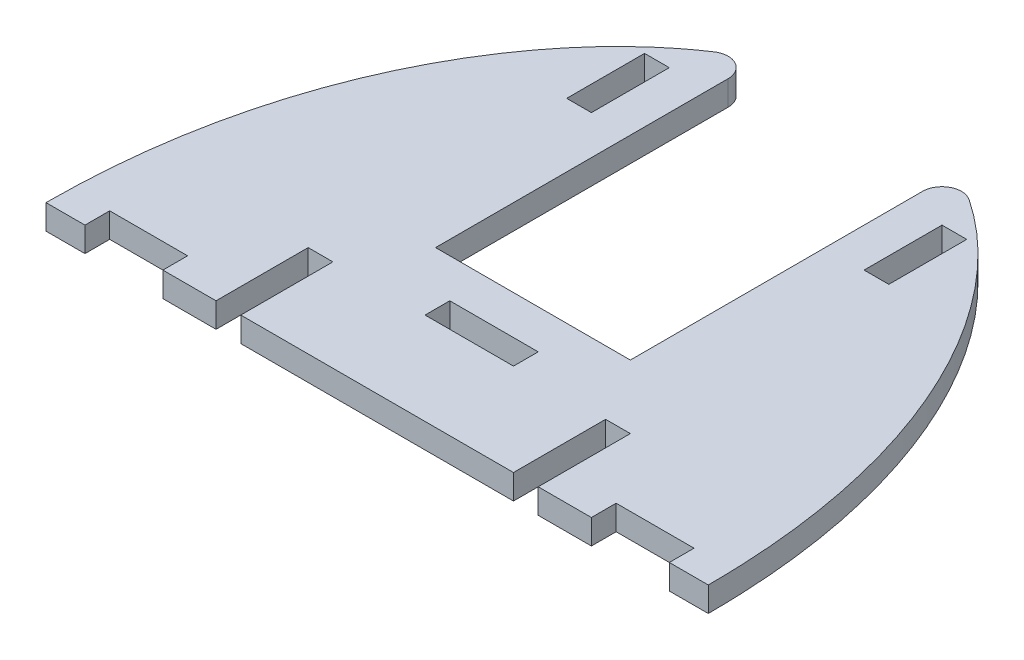
ISO-10303-21;
HEADER;
FILE_DESCRIPTION(('STEP AP214'),'2;1');
FILE_NAME('part.step','',(''),(''),'','','');
FILE_SCHEMA(('AUTOMOTIVE_DESIGN { 1 0 10303 214 1 1 1 1 }'));
ENDSEC;
DATA;
#1=APPLICATION_CONTEXT('core data for automotive mechanical design processes');
#2=APPLICATION_PROTOCOL_DEFINITION('international standard','automotive_design',2000,#1);
#3=PRODUCT_CONTEXT('',#1,'mechanical');
#4=PRODUCT('Part','Part','',(#3));
#5=PRODUCT_RELATED_PRODUCT_CATEGORY('part','',(#4));
#6=PRODUCT_DEFINITION_FORMATION('','',#4);
#7=PRODUCT_DEFINITION_CONTEXT('part definition',#1,'design');
#8=PRODUCT_DEFINITION('design','',#6,#7);
#9=PRODUCT_DEFINITION_SHAPE('','',#8);
#10=(LENGTH_UNIT() NAMED_UNIT(*) SI_UNIT(.MILLI.,.METRE.));
#11=(NAMED_UNIT(*) PLANE_ANGLE_UNIT() SI_UNIT($,.RADIAN.));
#12=(NAMED_UNIT(*) SI_UNIT($,.STERADIAN.) SOLID_ANGLE_UNIT());
#13=UNCERTAINTY_MEASURE_WITH_UNIT(LENGTH_MEASURE(1.E-05),#10,'distance_accuracy_value','');
#14=(GEOMETRIC_REPRESENTATION_CONTEXT(3) GLOBAL_UNCERTAINTY_ASSIGNED_CONTEXT((#13)) GLOBAL_UNIT_ASSIGNED_CONTEXT((#10,
#11,#12)) REPRESENTATION_CONTEXT('',''));
#15=CARTESIAN_POINT('',(0.,0.,0.));
#16=DIRECTION('',(0.,0.,1.));
#17=DIRECTION('',(1.,0.,0.));
#18=AXIS2_PLACEMENT_3D('',#15,#16,#17);
#19=CARTESIAN_POINT('',(0.,3.175,0.));
#20=DIRECTION('',(0.,0.,-1.));
#21=DIRECTION('',(-1.,0.,0.));
#22=AXIS2_PLACEMENT_3D('',#19,#20,#21);
#23=PLANE('',#22);
#24=DIRECTION('',(1.,0.,0.));
#25=VECTOR('',#24,1.);
#26=CARTESIAN_POINT('',(0.,0.,0.));
#27=LINE('',#26,#25);
#28=CARTESIAN_POINT('',(0.,0.,0.));
#29=VERTEX_POINT('',#28);
#30=CARTESIAN_POINT('',(5.,0.,0.));
#31=VERTEX_POINT('',#30);
#32=EDGE_CURVE('E603',#29,#31,#27,.T.);
#33=ORIENTED_EDGE('',*,*,#32,.T.);
#34=DIRECTION('',(0.,1.,0.));
#35=VECTOR('',#34,1.);
#36=CARTESIAN_POINT('',(5.,0.,0.));
#37=LINE('',#36,#35);
#38=CARTESIAN_POINT('',(5.,3.175,0.));
#39=VERTEX_POINT('',#38);
#40=EDGE_CURVE('E355',#31,#39,#37,.T.);
#41=ORIENTED_EDGE('',*,*,#40,.T.);
#42=DIRECTION('',(1.,0.,0.));
#43=VECTOR('',#42,1.);
#44=CARTESIAN_POINT('',(0.,3.175,0.));
#45=LINE('',#44,#43);
#46=CARTESIAN_POINT('',(0.,3.175,0.));
#47=VERTEX_POINT('',#46);
#48=EDGE_CURVE('E507',#47,#39,#45,.T.);
#49=ORIENTED_EDGE('',*,*,#48,.F.);
#50=DIRECTION('',(0.,-1.,0.));
#51=VECTOR('',#50,1.);
#52=CARTESIAN_POINT('',(0.,3.175,0.));
#53=LINE('',#52,#51);
#54=EDGE_CURVE('E598',#47,#29,#53,.T.);
#55=ORIENTED_EDGE('',*,*,#54,.T.);
#56=EDGE_LOOP('',(#33,#41,#49,#55));
#57=FACE_BOUND('',#56,.T.);
#58=ADVANCED_FACE('F35',(#57),#23,.F.);
#59=CARTESIAN_POINT('',(0.,3.175,0.));
#60=CARTESIAN_POINT('',(-4.55885329486704E-13,3.175,-36.));
#61=CARTESIAN_POINT('',(22.3987373470688,3.175,-65.1748553419662));
#62=CARTESIAN_POINT('',(62.2975079140465,3.175,-65.3077234127981));
#63=CARTESIAN_POINT('',(85.,3.175,-36.));
#64=CARTESIAN_POINT('',(85.,3.175,0.));
#65=B_SPLINE_CURVE_WITH_KNOTS('',3,(#59,#60,#61,#62,#63,#64),.UNSPECIFIED.,.F.,.F.,(4,1,1,4),
(0.,0.452811162525175,0.552811162525175,1.),.UNSPECIFIED.);
#66=DIRECTION('',(0.,-1.,0.));
#67=VECTOR('',#66,1.);
#68=SURFACE_OF_LINEAR_EXTRUSION('',#65,#67);
#69=CARTESIAN_POINT('',(26.1192033013856,3.175,-59.6339964677522));
#70=VERTEX_POINT('',#69);
#71=EDGE_CURVE('E500',#47,#70,#65,.T.);
#72=ORIENTED_EDGE('',*,*,#71,.T.);
#73=DIRECTION('',(0.,-1.,0.));
#74=VECTOR('',#73,1.);
#75=CARTESIAN_POINT('',(26.1192033013878,3.175,-59.6339964677536));
#76=LINE('',#75,#74);
#77=CARTESIAN_POINT('',(26.1192033013856,0.,-59.6339964677522));
#78=VERTEX_POINT('',#77);
#79=EDGE_CURVE('E11',#70,#78,#76,.T.);
#80=ORIENTED_EDGE('',*,*,#79,.T.);
#81=CARTESIAN_POINT('',(0.,0.,0.));
#82=CARTESIAN_POINT('',(-4.55885329486704E-13,0.,-36.));
#83=CARTESIAN_POINT('',(22.3987373470688,0.,-65.1748553419662));
#84=CARTESIAN_POINT('',(62.2975079140465,0.,-65.3077234127981));
#85=CARTESIAN_POINT('',(85.,0.,-36.));
#86=CARTESIAN_POINT('',(85.,0.,0.));
#87=B_SPLINE_CURVE_WITH_KNOTS('',3,(#81,#82,#83,#84,#85,#86),.UNSPECIFIED.,.F.,.F.,(4,1,1,4),
(0.,0.452811162525175,0.552811162525175,1.),.UNSPECIFIED.);
#88=EDGE_CURVE('E631',#29,#78,#87,.T.);
#89=ORIENTED_EDGE('',*,*,#88,.F.);
#90=ORIENTED_EDGE('',*,*,#54,.F.);
#91=EDGE_LOOP('',(#72,#80,#89,#90));
#92=FACE_BOUND('',#91,.T.);
#93=ADVANCED_FACE('F519',(#92),#68,.T.);
#94=CARTESIAN_POINT('',(63.1750000000003,0.,0.));
#95=VERTEX_POINT('',#94);
#96=CARTESIAN_POINT('',(70.,0.,0.));
#97=VERTEX_POINT('',#96);
#98=EDGE_CURVE('E585',#95,#97,#27,.T.);
#99=ORIENTED_EDGE('',*,*,#98,.T.);
#100=DIRECTION('',(0.,1.,0.));
#101=VECTOR('',#100,1.);
#102=CARTESIAN_POINT('',(70.,0.,0.));
#103=LINE('',#102,#101);
#104=CARTESIAN_POINT('',(70.,3.175,0.));
#105=VERTEX_POINT('',#104);
#106=EDGE_CURVE('E381',#97,#105,#103,.T.);
#107=ORIENTED_EDGE('',*,*,#106,.T.);
#108=CARTESIAN_POINT('',(63.1750000000003,3.175,0.));
#109=VERTEX_POINT('',#108);
#110=EDGE_CURVE('E569',#109,#105,#45,.T.);
#111=ORIENTED_EDGE('',*,*,#110,.F.);
#112=DIRECTION('',(0.,1.,0.));
#113=VECTOR('',#112,1.);
#114=CARTESIAN_POINT('',(63.1750000000003,0.,0.));
#115=LINE('',#114,#113);
#116=EDGE_CURVE('E415',#95,#109,#115,.T.);
#117=ORIENTED_EDGE('',*,*,#116,.F.);
#118=EDGE_LOOP('',(#99,#107,#111,#117));
#119=FACE_BOUND('',#118,.T.);
#120=ADVANCED_FACE('F535',(#119),#23,.F.);
#121=CARTESIAN_POINT('',(80.,3.175,0.));
#122=VERTEX_POINT('',#121);
#123=CARTESIAN_POINT('',(85.,3.175,0.));
#124=VERTEX_POINT('',#123);
#125=EDGE_CURVE('E505',#122,#124,#45,.T.);
#126=ORIENTED_EDGE('',*,*,#125,.F.);
#127=DIRECTION('',(0.,1.,0.));
#128=VECTOR('',#127,1.);
#129=CARTESIAN_POINT('',(80.,0.,0.));
#130=LINE('',#129,#128);
#131=CARTESIAN_POINT('',(80.,0.,0.));
#132=VERTEX_POINT('',#131);
#133=EDGE_CURVE('E392',#132,#122,#130,.T.);
#134=ORIENTED_EDGE('',*,*,#133,.F.);
#135=CARTESIAN_POINT('',(85.,0.,0.));
#136=VERTEX_POINT('',#135);
#137=EDGE_CURVE('E596',#132,#136,#27,.T.);
#138=ORIENTED_EDGE('',*,*,#137,.T.);
#139=DIRECTION('',(0.,-1.,0.));
#140=VECTOR('',#139,1.);
#141=CARTESIAN_POINT('',(85.,3.175,0.));
#142=LINE('',#141,#140);
#143=EDGE_CURVE('E567',#124,#136,#142,.T.);
#144=ORIENTED_EDGE('',*,*,#143,.F.);
#145=EDGE_LOOP('',(#126,#134,#138,#144));
#146=FACE_BOUND('',#145,.T.);
#147=ADVANCED_FACE('F542',(#146),#23,.F.);
#148=CARTESIAN_POINT('',(15.,3.175,0.));
#149=VERTEX_POINT('',#148);
#150=CARTESIAN_POINT('',(21.8250000000003,3.175,0.));
#151=VERTEX_POINT('',#150);
#152=EDGE_CURVE('E560',#149,#151,#45,.T.);
#153=ORIENTED_EDGE('',*,*,#152,.F.);
#154=DIRECTION('',(0.,1.,0.));
#155=VECTOR('',#154,1.);
#156=CARTESIAN_POINT('',(15.,0.,0.));
#157=LINE('',#156,#155);
#158=CARTESIAN_POINT('',(15.,0.,0.));
#159=VERTEX_POINT('',#158);
#160=EDGE_CURVE('E367',#159,#149,#157,.T.);
#161=ORIENTED_EDGE('',*,*,#160,.F.);
#162=CARTESIAN_POINT('',(21.8250000000003,0.,0.));
#163=VERTEX_POINT('',#162);
#164=EDGE_CURVE('E988',#159,#163,#27,.T.);
#165=ORIENTED_EDGE('',*,*,#164,.T.);
#166=DIRECTION('',(0.,1.,0.));
#167=VECTOR('',#166,1.);
#168=CARTESIAN_POINT('',(21.8250000000003,0.,0.));
#169=LINE('',#168,#167);
#170=EDGE_CURVE('E491',#163,#151,#169,.T.);
#171=ORIENTED_EDGE('',*,*,#170,.T.);
#172=EDGE_LOOP('',(#153,#161,#165,#171));
#173=FACE_BOUND('',#172,.T.);
#174=ADVANCED_FACE('F517',(#173),#23,.F.);
#175=CARTESIAN_POINT('',(58.8890568242253,0.,-59.5813314436903));
#176=VERTEX_POINT('',#175);
#177=EDGE_CURVE('E494',#176,#136,#87,.T.);
#178=ORIENTED_EDGE('',*,*,#177,.F.);
#179=DIRECTION('',(0.,-1.,0.));
#180=VECTOR('',#179,1.);
#181=CARTESIAN_POINT('',(58.8890568242253,0.,-59.5813314436903));
#182=LINE('',#181,#180);
#183=CARTESIAN_POINT('',(58.8890568242253,3.175,-59.5813314436903));
#184=VERTEX_POINT('',#183);
#185=EDGE_CURVE('E613',#176,#184,#182,.F.);
#186=ORIENTED_EDGE('',*,*,#185,.T.);
#187=EDGE_CURVE('E506',#184,#124,#65,.T.);
#188=ORIENTED_EDGE('',*,*,#187,.T.);
#189=ORIENTED_EDGE('',*,*,#143,.T.);
#190=EDGE_LOOP('',(#178,#186,#188,#189));
#191=FACE_BOUND('',#190,.T.);
#192=ADVANCED_FACE('F513',(#191),#68,.T.);
#193=CARTESIAN_POINT('',(25.0000000000003,0.,0.));
#194=VERTEX_POINT('',#193);
#195=CARTESIAN_POINT('',(60.0000000000003,0.,0.));
#196=VERTEX_POINT('',#195);
#197=EDGE_CURVE('E984',#194,#196,#27,.T.);
#198=ORIENTED_EDGE('',*,*,#197,.T.);
#199=DIRECTION('',(0.,1.,0.));
#200=VECTOR('',#199,1.);
#201=CARTESIAN_POINT('',(60.0000000000003,0.,0.));
#202=LINE('',#201,#200);
#203=CARTESIAN_POINT('',(60.0000000000003,3.175,0.));
#204=VERTEX_POINT('',#203);
#205=EDGE_CURVE('E418',#196,#204,#202,.T.);
#206=ORIENTED_EDGE('',*,*,#205,.T.);
#207=CARTESIAN_POINT('',(25.0000000000003,3.175,0.));
#208=VERTEX_POINT('',#207);
#209=EDGE_CURVE('E565',#208,#204,#45,.T.);
#210=ORIENTED_EDGE('',*,*,#209,.F.);
#211=DIRECTION('',(0.,1.,0.));
#212=VECTOR('',#211,1.);
#213=CARTESIAN_POINT('',(25.0000000000003,0.,0.));
#214=LINE('',#213,#212);
#215=EDGE_CURVE('E483',#194,#208,#214,.T.);
#216=ORIENTED_EDGE('',*,*,#215,.F.);
#217=EDGE_LOOP('',(#198,#206,#210,#216));
#218=FACE_BOUND('',#217,.T.);
#219=ADVANCED_FACE('F516',(#218),#23,.F.);
#220=CARTESIAN_POINT('',(0.,3.175,0.));
#221=DIRECTION('',(0.,1.,0.));
#222=DIRECTION('',(0.,0.,1.));
#223=AXIS2_PLACEMENT_3D('',#220,#221,#222);
#224=PLANE('',#223);
#225=ORIENTED_EDGE('',*,*,#187,.F.);
#226=CARTESIAN_POINT('',(57.5000000000003,3.175,-57.5027451118113));
#227=DIRECTION('',(0.,1.,0.));
#228=DIRECTION('',(0.,0.,1.));
#229=AXIS2_PLACEMENT_3D('',#226,#227,#228);
#230=CIRCLE('',#229,2.5);
#231=CARTESIAN_POINT('',(55.0000000000004,3.175,-57.5027451118113));
#232=VERTEX_POINT('',#231);
#233=EDGE_CURVE('E616',#184,#232,#230,.T.);
#234=ORIENTED_EDGE('',*,*,#233,.T.);
#235=DIRECTION('',(0.,0.,-1.));
#236=VECTOR('',#235,1.);
#237=CARTESIAN_POINT('',(55.0000000000004,3.175,-20.));
#238=LINE('',#237,#236);
#239=CARTESIAN_POINT('',(55.0000000000004,3.175,-20.));
#240=VERTEX_POINT('',#239);
#241=EDGE_CURVE('E460',#240,#232,#238,.T.);
#242=ORIENTED_EDGE('',*,*,#241,.F.);
#243=DIRECTION('',(1.,0.,0.));
#244=VECTOR('',#243,1.);
#245=CARTESIAN_POINT('',(30.0000000000004,3.175,-20.));
#246=LINE('',#245,#244);
#247=CARTESIAN_POINT('',(30.0000000000004,3.175,-20.));
#248=VERTEX_POINT('',#247);
#249=EDGE_CURVE('E465',#248,#240,#246,.T.);
#250=ORIENTED_EDGE('',*,*,#249,.F.);
#251=DIRECTION('',(0.,0.,1.));
#252=VECTOR('',#251,1.);
#253=CARTESIAN_POINT('',(30.0000000000004,3.175,-20.));
#254=LINE('',#253,#252);
#255=CARTESIAN_POINT('',(30.0000000000004,3.175,-57.5499138213356));
#256=VERTEX_POINT('',#255);
#257=EDGE_CURVE('E309',#256,#248,#254,.T.);
#258=ORIENTED_EDGE('',*,*,#257,.F.);
#259=CARTESIAN_POINT('',(27.5000000000004,3.175,-57.5499138213356));
#260=DIRECTION('',(0.,1.,0.));
#261=DIRECTION('',(0.,0.,1.));
#262=AXIS2_PLACEMENT_3D('',#259,#260,#261);
#263=CIRCLE('',#262,2.5);
#264=EDGE_CURVE('E50',#256,#70,#263,.T.);
#265=ORIENTED_EDGE('',*,*,#264,.T.);
#266=ORIENTED_EDGE('',*,*,#71,.F.);
#267=ORIENTED_EDGE('',*,*,#48,.T.);
#268=DIRECTION('',(0.,0.,1.));
#269=VECTOR('',#268,1.);
#270=CARTESIAN_POINT('',(5.,3.175,0.));
#271=LINE('',#270,#269);
#272=CARTESIAN_POINT('',(5.,3.175,-3.175));
#273=VERTEX_POINT('',#272);
#274=EDGE_CURVE('E356',#273,#39,#271,.T.);
#275=ORIENTED_EDGE('',*,*,#274,.F.);
#276=DIRECTION('',(-1.,0.,0.));
#277=VECTOR('',#276,1.);
#278=CARTESIAN_POINT('',(5.,3.175,-3.175));
#279=LINE('',#278,#277);
#280=CARTESIAN_POINT('',(15.,3.175,-3.175));
#281=VERTEX_POINT('',#280);
#282=EDGE_CURVE('E349',#281,#273,#279,.T.);
#283=ORIENTED_EDGE('',*,*,#282,.F.);
#284=DIRECTION('',(0.,0.,-1.));
#285=VECTOR('',#284,1.);
#286=CARTESIAN_POINT('',(15.,3.175,0.));
#287=LINE('',#286,#285);
#288=EDGE_CURVE('E358',#149,#281,#287,.T.);
#289=ORIENTED_EDGE('',*,*,#288,.F.);
#290=ORIENTED_EDGE('',*,*,#152,.T.);
#291=DIRECTION('',(0.,0.,1.));
#292=VECTOR('',#291,1.);
#293=CARTESIAN_POINT('',(21.8250000000003,3.175,0.));
#294=LINE('',#293,#292);
#295=CARTESIAN_POINT('',(21.8250000000003,3.175,-11.825));
#296=VERTEX_POINT('',#295);
#297=EDGE_CURVE('E477',#296,#151,#294,.T.);
#298=ORIENTED_EDGE('',*,*,#297,.F.);
#299=DIRECTION('',(-1.,0.,0.));
#300=VECTOR('',#299,1.);
#301=CARTESIAN_POINT('',(21.8250000000003,3.175,-11.825));
#302=LINE('',#301,#300);
#303=CARTESIAN_POINT('',(25.0000000000003,3.175,-11.825));
#304=VERTEX_POINT('',#303);
#305=EDGE_CURVE('E486',#304,#296,#302,.T.);
#306=ORIENTED_EDGE('',*,*,#305,.F.);
#307=DIRECTION('',(0.,0.,-1.));
#308=VECTOR('',#307,1.);
#309=CARTESIAN_POINT('',(25.0000000000003,3.175,-11.825));
#310=LINE('',#309,#308);
#311=EDGE_CURVE('E417',#208,#304,#310,.T.);
#312=ORIENTED_EDGE('',*,*,#311,.F.);
#313=ORIENTED_EDGE('',*,*,#209,.T.);
#314=DIRECTION('',(0.,0.,1.));
#315=VECTOR('',#314,1.);
#316=CARTESIAN_POINT('',(60.0000000000003,3.175,0.));
#317=LINE('',#316,#315);
#318=CARTESIAN_POINT('',(60.0000000000003,3.175,-11.825));
#319=VERTEX_POINT('',#318);
#320=EDGE_CURVE('E400',#319,#204,#317,.T.);
#321=ORIENTED_EDGE('',*,*,#320,.F.);
#322=DIRECTION('',(-1.,0.,0.));
#323=VECTOR('',#322,1.);
#324=CARTESIAN_POINT('',(63.1750000000003,3.175,-11.825));
#325=LINE('',#324,#323);
#326=CARTESIAN_POINT('',(63.1750000000003,3.175,-11.825));
#327=VERTEX_POINT('',#326);
#328=EDGE_CURVE('E410',#327,#319,#325,.T.);
#329=ORIENTED_EDGE('',*,*,#328,.F.);
#330=DIRECTION('',(0.,0.,-1.));
#331=VECTOR('',#330,1.);
#332=CARTESIAN_POINT('',(63.1750000000003,3.175,0.));
#333=LINE('',#332,#331);
#334=EDGE_CURVE('E407',#109,#327,#333,.T.);
#335=ORIENTED_EDGE('',*,*,#334,.F.);
#336=ORIENTED_EDGE('',*,*,#110,.T.);
#337=DIRECTION('',(0.,0.,1.));
#338=VECTOR('',#337,1.);
#339=CARTESIAN_POINT('',(70.,3.175,0.));
#340=LINE('',#339,#338);
#341=CARTESIAN_POINT('',(70.,3.175,-3.175));
#342=VERTEX_POINT('',#341);
#343=EDGE_CURVE('E382',#342,#105,#340,.T.);
#344=ORIENTED_EDGE('',*,*,#343,.F.);
#345=DIRECTION('',(-1.,0.,0.));
#346=VECTOR('',#345,1.);
#347=CARTESIAN_POINT('',(70.,3.175,-3.175));
#348=LINE('',#347,#346);
#349=CARTESIAN_POINT('',(80.,3.175,-3.175));
#350=VERTEX_POINT('',#349);
#351=EDGE_CURVE('E375',#350,#342,#348,.T.);
#352=ORIENTED_EDGE('',*,*,#351,.F.);
#353=DIRECTION('',(0.,0.,-1.));
#354=VECTOR('',#353,1.);
#355=CARTESIAN_POINT('',(80.,3.175,0.));
#356=LINE('',#355,#354);
#357=EDGE_CURVE('E384',#122,#350,#356,.T.);
#358=ORIENTED_EDGE('',*,*,#357,.F.);
#359=ORIENTED_EDGE('',*,*,#125,.T.);
#360=EDGE_LOOP('',(#225,#234,#242,#250,#258,#265,#266,#267,#275,#283,#289,#290,#298,#306,#312,
#313,#321,#329,#335,#336,#344,#352,#358,#359));
#361=FACE_BOUND('',#360,.T.);
#362=DIRECTION('',(0.,0.,1.));
#363=VECTOR('',#362,1.);
#364=CARTESIAN_POINT('',(21.8250000000004,3.175,-45.));
#365=LINE('',#364,#363);
#366=CARTESIAN_POINT('',(21.8250000000003,3.175,-55.));
#367=VERTEX_POINT('',#366);
#368=CARTESIAN_POINT('',(21.8250000000004,3.175,-45.));
#369=VERTEX_POINT('',#368);
#370=EDGE_CURVE('E327',#367,#369,#365,.T.);
#371=ORIENTED_EDGE('',*,*,#370,.F.);
#372=DIRECTION('',(-1.,0.,0.));
#373=VECTOR('',#372,1.);
#374=CARTESIAN_POINT('',(21.8250000000003,3.175,-55.));
#375=LINE('',#374,#373);
#376=CARTESIAN_POINT('',(25.0000000000004,3.175,-55.));
#377=VERTEX_POINT('',#376);
#378=EDGE_CURVE('E317',#377,#367,#375,.T.);
#379=ORIENTED_EDGE('',*,*,#378,.F.);
#380=DIRECTION('',(0.,0.,-1.));
#381=VECTOR('',#380,1.);
#382=CARTESIAN_POINT('',(25.0000000000003,3.175,-45.));
#383=LINE('',#382,#381);
#384=CARTESIAN_POINT('',(25.0000000000003,3.175,-45.));
#385=VERTEX_POINT('',#384);
#386=EDGE_CURVE('E333',#385,#377,#383,.T.);
#387=ORIENTED_EDGE('',*,*,#386,.F.);
#388=DIRECTION('',(1.,0.,0.));
#389=VECTOR('',#388,1.);
#390=CARTESIAN_POINT('',(21.8250000000004,3.175,-45.));
#391=LINE('',#390,#389);
#392=EDGE_CURVE('E329',#369,#385,#391,.T.);
#393=ORIENTED_EDGE('',*,*,#392,.F.);
#394=EDGE_LOOP('',(#371,#379,#387,#393));
#395=FACE_BOUND('',#394,.T.);
#396=DIRECTION('',(0.,0.,-1.));
#397=VECTOR('',#396,1.);
#398=CARTESIAN_POINT('',(63.1750000000004,3.175,-55.));
#399=LINE('',#398,#397);
#400=CARTESIAN_POINT('',(63.1750000000003,3.175,-45.));
#401=VERTEX_POINT('',#400);
#402=CARTESIAN_POINT('',(63.1750000000004,3.175,-55.));
#403=VERTEX_POINT('',#402);
#404=EDGE_CURVE('E275',#401,#403,#399,.T.);
#405=ORIENTED_EDGE('',*,*,#404,.F.);
#406=DIRECTION('',(1.,0.,0.));
#407=VECTOR('',#406,1.);
#408=CARTESIAN_POINT('',(63.1750000000003,3.175,-45.));
#409=LINE('',#408,#407);
#410=CARTESIAN_POINT('',(60.0000000000004,3.175,-45.));
#411=VERTEX_POINT('',#410);
#412=EDGE_CURVE('E293',#411,#401,#409,.T.);
#413=ORIENTED_EDGE('',*,*,#412,.F.);
#414=DIRECTION('',(0.,0.,1.));
#415=VECTOR('',#414,1.);
#416=CARTESIAN_POINT('',(60.0000000000003,3.175,-55.));
#417=LINE('',#416,#415);
#418=CARTESIAN_POINT('',(60.0000000000003,3.175,-55.));
#419=VERTEX_POINT('',#418);
#420=EDGE_CURVE('E296',#419,#411,#417,.T.);
#421=ORIENTED_EDGE('',*,*,#420,.F.);
#422=DIRECTION('',(-1.,0.,0.));
#423=VECTOR('',#422,1.);
#424=CARTESIAN_POINT('',(63.1750000000004,3.175,-55.));
#425=LINE('',#424,#423);
#426=EDGE_CURVE('E302',#403,#419,#425,.T.);
#427=ORIENTED_EDGE('',*,*,#426,.F.);
#428=EDGE_LOOP('',(#405,#413,#421,#427));
#429=FACE_BOUND('',#428,.T.);
#430=DIRECTION('',(0.,0.,1.));
#431=VECTOR('',#430,1.);
#432=CARTESIAN_POINT('',(36.8250000000003,3.175,-15.));
#433=LINE('',#432,#431);
#434=CARTESIAN_POINT('',(36.8250000000003,3.175,-15.));
#435=VERTEX_POINT('',#434);
#436=CARTESIAN_POINT('',(36.8250000000003,3.175,-11.825));
#437=VERTEX_POINT('',#436);
#438=EDGE_CURVE('E438',#435,#437,#433,.T.);
#439=ORIENTED_EDGE('',*,*,#438,.F.);
#440=DIRECTION('',(-1.,0.,0.));
#441=VECTOR('',#440,1.);
#442=CARTESIAN_POINT('',(36.8250000000003,3.175,-15.));
#443=LINE('',#442,#441);
#444=CARTESIAN_POINT('',(48.1750000000003,3.175,-15.));
#445=VERTEX_POINT('',#444);
#446=EDGE_CURVE('E428',#445,#435,#443,.T.);
#447=ORIENTED_EDGE('',*,*,#446,.F.);
#448=DIRECTION('',(0.,0.,-1.));
#449=VECTOR('',#448,1.);
#450=CARTESIAN_POINT('',(48.1750000000003,3.175,-15.));
#451=LINE('',#450,#449);
#452=CARTESIAN_POINT('',(48.1750000000003,3.175,-11.825));
#453=VERTEX_POINT('',#452);
#454=EDGE_CURVE('E444',#453,#445,#451,.T.);
#455=ORIENTED_EDGE('',*,*,#454,.F.);
#456=DIRECTION('',(1.,0.,0.));
#457=VECTOR('',#456,1.);
#458=CARTESIAN_POINT('',(36.8250000000003,3.175,-11.825));
#459=LINE('',#458,#457);
#460=EDGE_CURVE('E440',#437,#453,#459,.T.);
#461=ORIENTED_EDGE('',*,*,#460,.F.);
#462=EDGE_LOOP('',(#439,#447,#455,#461));
#463=FACE_BOUND('',#462,.T.);
#464=ADVANCED_FACE('F545',(#361,#395,#429,#463),#224,.T.);
#465=CARTESIAN_POINT('',(0.,0.,0.));
#466=DIRECTION('',(0.,1.,0.));
#467=DIRECTION('',(0.,0.,1.));
#468=AXIS2_PLACEMENT_3D('',#465,#466,#467);
#469=PLANE('',#468);
#470=DIRECTION('',(-1.,0.,0.));
#471=VECTOR('',#470,1.);
#472=CARTESIAN_POINT('',(21.8250000000003,0.,-55.));
#473=LINE('',#472,#471);
#474=CARTESIAN_POINT('',(25.0000000000004,0.,-55.));
#475=VERTEX_POINT('',#474);
#476=CARTESIAN_POINT('',(21.8250000000003,0.,-55.));
#477=VERTEX_POINT('',#476);
#478=EDGE_CURVE('E323',#475,#477,#473,.T.);
#479=ORIENTED_EDGE('',*,*,#478,.T.);
#480=DIRECTION('',(0.,0.,1.));
#481=VECTOR('',#480,1.);
#482=CARTESIAN_POINT('',(21.8250000000004,0.,-45.));
#483=LINE('',#482,#481);
#484=CARTESIAN_POINT('',(21.8250000000004,0.,-45.));
#485=VERTEX_POINT('',#484);
#486=EDGE_CURVE('E313',#477,#485,#483,.T.);
#487=ORIENTED_EDGE('',*,*,#486,.T.);
#488=DIRECTION('',(1.,0.,0.));
#489=VECTOR('',#488,1.);
#490=CARTESIAN_POINT('',(21.8250000000004,0.,-45.));
#491=LINE('',#490,#489);
#492=CARTESIAN_POINT('',(25.0000000000003,0.,-45.));
#493=VERTEX_POINT('',#492);
#494=EDGE_CURVE('E316',#485,#493,#491,.T.);
#495=ORIENTED_EDGE('',*,*,#494,.T.);
#496=DIRECTION('',(0.,0.,-1.));
#497=VECTOR('',#496,1.);
#498=CARTESIAN_POINT('',(25.0000000000003,0.,-45.));
#499=LINE('',#498,#497);
#500=EDGE_CURVE('E320',#493,#475,#499,.T.);
#501=ORIENTED_EDGE('',*,*,#500,.T.);
#502=EDGE_LOOP('',(#479,#487,#495,#501));
#503=FACE_BOUND('',#502,.T.);
#504=DIRECTION('',(1.,0.,0.));
#505=VECTOR('',#504,1.);
#506=CARTESIAN_POINT('',(63.1750000000003,0.,-45.));
#507=LINE('',#506,#505);
#508=CARTESIAN_POINT('',(60.0000000000004,0.,-45.));
#509=VERTEX_POINT('',#508);
#510=CARTESIAN_POINT('',(63.1750000000003,0.,-45.));
#511=VERTEX_POINT('',#510);
#512=EDGE_CURVE('E280',#509,#511,#507,.T.);
#513=ORIENTED_EDGE('',*,*,#512,.T.);
#514=DIRECTION('',(0.,0.,-1.));
#515=VECTOR('',#514,1.);
#516=CARTESIAN_POINT('',(63.1750000000004,0.,-55.));
#517=LINE('',#516,#515);
#518=CARTESIAN_POINT('',(63.1750000000004,0.,-55.));
#519=VERTEX_POINT('',#518);
#520=EDGE_CURVE('E272',#511,#519,#517,.T.);
#521=ORIENTED_EDGE('',*,*,#520,.T.);
#522=DIRECTION('',(-1.,0.,0.));
#523=VECTOR('',#522,1.);
#524=CARTESIAN_POINT('',(63.1750000000004,0.,-55.));
#525=LINE('',#524,#523);
#526=CARTESIAN_POINT('',(60.0000000000003,0.,-55.));
#527=VERTEX_POINT('',#526);
#528=EDGE_CURVE('E284',#519,#527,#525,.T.);
#529=ORIENTED_EDGE('',*,*,#528,.T.);
#530=DIRECTION('',(0.,0.,1.));
#531=VECTOR('',#530,1.);
#532=CARTESIAN_POINT('',(60.0000000000003,0.,-55.));
#533=LINE('',#532,#531);
#534=EDGE_CURVE('E288',#527,#509,#533,.T.);
#535=ORIENTED_EDGE('',*,*,#534,.T.);
#536=EDGE_LOOP('',(#513,#521,#529,#535));
#537=FACE_BOUND('',#536,.T.);
#538=DIRECTION('',(0.,0.,-1.));
#539=VECTOR('',#538,1.);
#540=CARTESIAN_POINT('',(55.0000000000004,0.,-20.));
#541=LINE('',#540,#539);
#542=CARTESIAN_POINT('',(55.0000000000004,0.,-20.));
#543=VERTEX_POINT('',#542);
#544=CARTESIAN_POINT('',(55.0000000000004,0.,-57.5027451118113));
#545=VERTEX_POINT('',#544);
#546=EDGE_CURVE('E459',#543,#545,#541,.T.);
#547=ORIENTED_EDGE('',*,*,#546,.T.);
#548=CARTESIAN_POINT('',(57.5000000000003,0.,-57.5027451118113));
#549=DIRECTION('',(0.,1.,0.));
#550=DIRECTION('',(0.,0.,1.));
#551=AXIS2_PLACEMENT_3D('',#548,#549,#550);
#552=CIRCLE('',#551,2.5);
#553=EDGE_CURVE('E611',#545,#176,#552,.F.);
#554=ORIENTED_EDGE('',*,*,#553,.T.);
#555=ORIENTED_EDGE('',*,*,#177,.T.);
#556=ORIENTED_EDGE('',*,*,#137,.F.);
#557=DIRECTION('',(0.,0.,-1.));
#558=VECTOR('',#557,1.);
#559=CARTESIAN_POINT('',(80.,0.,0.));
#560=LINE('',#559,#558);
#561=CARTESIAN_POINT('',(80.,0.,-3.175));
#562=VERTEX_POINT('',#561);
#563=EDGE_CURVE('E374',#132,#562,#560,.T.);
#564=ORIENTED_EDGE('',*,*,#563,.T.);
#565=DIRECTION('',(-1.,0.,0.));
#566=VECTOR('',#565,1.);
#567=CARTESIAN_POINT('',(70.,0.,-3.175));
#568=LINE('',#567,#566);
#569=CARTESIAN_POINT('',(70.,0.,-3.175));
#570=VERTEX_POINT('',#569);
#571=EDGE_CURVE('E378',#562,#570,#568,.T.);
#572=ORIENTED_EDGE('',*,*,#571,.T.);
#573=DIRECTION('',(0.,0.,1.));
#574=VECTOR('',#573,1.);
#575=CARTESIAN_POINT('',(70.,0.,0.));
#576=LINE('',#575,#574);
#577=EDGE_CURVE('E371',#570,#97,#576,.T.);
#578=ORIENTED_EDGE('',*,*,#577,.T.);
#579=ORIENTED_EDGE('',*,*,#98,.F.);
#580=DIRECTION('',(0.,0.,-1.));
#581=VECTOR('',#580,1.);
#582=CARTESIAN_POINT('',(63.1750000000003,0.,0.));
#583=LINE('',#582,#581);
#584=CARTESIAN_POINT('',(63.1750000000003,0.,-11.825));
#585=VERTEX_POINT('',#584);
#586=EDGE_CURVE('E396',#95,#585,#583,.T.);
#587=ORIENTED_EDGE('',*,*,#586,.T.);
#588=DIRECTION('',(-1.,0.,0.));
#589=VECTOR('',#588,1.);
#590=CARTESIAN_POINT('',(63.1750000000003,0.,-11.825));
#591=LINE('',#590,#589);
#592=CARTESIAN_POINT('',(60.0000000000003,0.,-11.825));
#593=VERTEX_POINT('',#592);
#594=EDGE_CURVE('E399',#585,#593,#591,.T.);
#595=ORIENTED_EDGE('',*,*,#594,.T.);
#596=DIRECTION('',(0.,0.,1.));
#597=VECTOR('',#596,1.);
#598=CARTESIAN_POINT('',(60.0000000000003,0.,0.));
#599=LINE('',#598,#597);
#600=EDGE_CURVE('E403',#593,#196,#599,.T.);
#601=ORIENTED_EDGE('',*,*,#600,.T.);
#602=ORIENTED_EDGE('',*,*,#197,.F.);
#603=DIRECTION('',(0.,0.,-1.));
#604=VECTOR('',#603,1.);
#605=CARTESIAN_POINT('',(25.0000000000003,0.,-11.825));
#606=LINE('',#605,#604);
#607=CARTESIAN_POINT('',(25.0000000000003,0.,-11.825));
#608=VERTEX_POINT('',#607);
#609=EDGE_CURVE('E473',#194,#608,#606,.T.);
#610=ORIENTED_EDGE('',*,*,#609,.T.);
#611=DIRECTION('',(-1.,0.,0.));
#612=VECTOR('',#611,1.);
#613=CARTESIAN_POINT('',(21.8250000000003,0.,-11.825));
#614=LINE('',#613,#612);
#615=CARTESIAN_POINT('',(21.8250000000003,0.,-11.825));
#616=VERTEX_POINT('',#615);
#617=EDGE_CURVE('E476',#608,#616,#614,.T.);
#618=ORIENTED_EDGE('',*,*,#617,.T.);
#619=DIRECTION('',(0.,0.,1.));
#620=VECTOR('',#619,1.);
#621=CARTESIAN_POINT('',(21.8250000000003,0.,0.));
#622=LINE('',#621,#620);
#623=EDGE_CURVE('E480',#616,#163,#622,.T.);
#624=ORIENTED_EDGE('',*,*,#623,.T.);
#625=ORIENTED_EDGE('',*,*,#164,.F.);
#626=DIRECTION('',(0.,0.,-1.));
#627=VECTOR('',#626,1.);
#628=CARTESIAN_POINT('',(15.,0.,0.));
#629=LINE('',#628,#627);
#630=CARTESIAN_POINT('',(15.,0.,-3.175));
#631=VERTEX_POINT('',#630);
#632=EDGE_CURVE('E348',#159,#631,#629,.T.);
#633=ORIENTED_EDGE('',*,*,#632,.T.);
#634=DIRECTION('',(-1.,0.,0.));
#635=VECTOR('',#634,1.);
#636=CARTESIAN_POINT('',(5.,0.,-3.175));
#637=LINE('',#636,#635);
#638=CARTESIAN_POINT('',(5.,0.,-3.175));
#639=VERTEX_POINT('',#638);
#640=EDGE_CURVE('E352',#631,#639,#637,.T.);
#641=ORIENTED_EDGE('',*,*,#640,.T.);
#642=DIRECTION('',(0.,0.,1.));
#643=VECTOR('',#642,1.);
#644=CARTESIAN_POINT('',(5.,0.,0.));
#645=LINE('',#644,#643);
#646=EDGE_CURVE('E345',#639,#31,#645,.T.);
#647=ORIENTED_EDGE('',*,*,#646,.T.);
#648=ORIENTED_EDGE('',*,*,#32,.F.);
#649=ORIENTED_EDGE('',*,*,#88,.T.);
#650=CARTESIAN_POINT('',(27.5000000000004,0.,-57.5499138213356));
#651=DIRECTION('',(0.,1.,0.));
#652=DIRECTION('',(0.,0.,1.));
#653=AXIS2_PLACEMENT_3D('',#650,#651,#652);
#654=CIRCLE('',#653,2.5);
#655=CARTESIAN_POINT('',(30.0000000000004,0.,-57.5499138213356));
#656=VERTEX_POINT('',#655);
#657=EDGE_CURVE('E609',#78,#656,#654,.F.);
#658=ORIENTED_EDGE('',*,*,#657,.T.);
#659=DIRECTION('',(0.,0.,1.));
#660=VECTOR('',#659,1.);
#661=CARTESIAN_POINT('',(30.0000000000004,0.,0.));
#662=LINE('',#661,#660);
#663=CARTESIAN_POINT('',(30.0000000000004,0.,-20.));
#664=VERTEX_POINT('',#663);
#665=EDGE_CURVE('E600',#656,#664,#662,.T.);
#666=ORIENTED_EDGE('',*,*,#665,.T.);
#667=DIRECTION('',(1.,0.,0.));
#668=VECTOR('',#667,1.);
#669=CARTESIAN_POINT('',(30.0000000000004,0.,-20.));
#670=LINE('',#669,#668);
#671=EDGE_CURVE('E456',#664,#543,#670,.T.);
#672=ORIENTED_EDGE('',*,*,#671,.T.);
#673=EDGE_LOOP('',(#547,#554,#555,#556,#564,#572,#578,#579,#587,#595,#601,#602,#610,#618,#624,
#625,#633,#641,#647,#648,#649,#658,#666,#672));
#674=FACE_BOUND('',#673,.T.);
#675=DIRECTION('',(-1.,0.,0.));
#676=VECTOR('',#675,1.);
#677=CARTESIAN_POINT('',(36.8250000000003,0.,-15.));
#678=LINE('',#677,#676);
#679=CARTESIAN_POINT('',(48.1750000000003,0.,-15.));
#680=VERTEX_POINT('',#679);
#681=CARTESIAN_POINT('',(36.8250000000003,0.,-15.));
#682=VERTEX_POINT('',#681);
#683=EDGE_CURVE('E434',#680,#682,#678,.T.);
#684=ORIENTED_EDGE('',*,*,#683,.T.);
#685=DIRECTION('',(0.,0.,1.));
#686=VECTOR('',#685,1.);
#687=CARTESIAN_POINT('',(36.8250000000003,0.,-15.));
#688=LINE('',#687,#686);
#689=CARTESIAN_POINT('',(36.8250000000003,0.,-11.825));
#690=VERTEX_POINT('',#689);
#691=EDGE_CURVE('E424',#682,#690,#688,.T.);
#692=ORIENTED_EDGE('',*,*,#691,.T.);
#693=DIRECTION('',(1.,0.,0.));
#694=VECTOR('',#693,1.);
#695=CARTESIAN_POINT('',(36.8250000000003,0.,-11.825));
#696=LINE('',#695,#694);
#697=CARTESIAN_POINT('',(48.1750000000003,0.,-11.825));
#698=VERTEX_POINT('',#697);
#699=EDGE_CURVE('E427',#690,#698,#696,.T.);
#700=ORIENTED_EDGE('',*,*,#699,.T.);
#701=DIRECTION('',(0.,0.,-1.));
#702=VECTOR('',#701,1.);
#703=CARTESIAN_POINT('',(48.1750000000003,0.,-15.));
#704=LINE('',#703,#702);
#705=EDGE_CURVE('E431',#698,#680,#704,.T.);
#706=ORIENTED_EDGE('',*,*,#705,.T.);
#707=EDGE_LOOP('',(#684,#692,#700,#706));
#708=FACE_BOUND('',#707,.T.);
#709=ADVANCED_FACE('F290',(#503,#537,#674,#708),#469,.F.);
#710=CARTESIAN_POINT('',(21.8250000000003,0.,0.));
#711=DIRECTION('',(-1.,0.,0.));
#712=DIRECTION('',(0.,0.,1.));
#713=AXIS2_PLACEMENT_3D('',#710,#711,#712);
#714=PLANE('',#713);
#715=ORIENTED_EDGE('',*,*,#297,.T.);
#716=ORIENTED_EDGE('',*,*,#170,.F.);
#717=ORIENTED_EDGE('',*,*,#623,.F.);
#718=DIRECTION('',(0.,1.,0.));
#719=VECTOR('',#718,1.);
#720=CARTESIAN_POINT('',(21.8250000000003,0.,-11.825));
#721=LINE('',#720,#719);
#722=EDGE_CURVE('E495',#616,#296,#721,.T.);
#723=ORIENTED_EDGE('',*,*,#722,.T.);
#724=EDGE_LOOP('',(#715,#716,#717,#723));
#725=FACE_BOUND('',#724,.T.);
#726=ADVANCED_FACE('F695',(#725),#714,.F.);
#727=CARTESIAN_POINT('',(21.8250000000003,0.,-11.825));
#728=DIRECTION('',(0.,0.,-1.));
#729=DIRECTION('',(-1.,0.,0.));
#730=AXIS2_PLACEMENT_3D('',#727,#728,#729);
#731=PLANE('',#730);
#732=ORIENTED_EDGE('',*,*,#305,.T.);
#733=ORIENTED_EDGE('',*,*,#722,.F.);
#734=ORIENTED_EDGE('',*,*,#617,.F.);
#735=DIRECTION('',(0.,1.,0.));
#736=VECTOR('',#735,1.);
#737=CARTESIAN_POINT('',(25.0000000000003,0.,-11.825));
#738=LINE('',#737,#736);
#739=EDGE_CURVE('E497',#608,#304,#738,.T.);
#740=ORIENTED_EDGE('',*,*,#739,.T.);
#741=EDGE_LOOP('',(#732,#733,#734,#740));
#742=FACE_BOUND('',#741,.T.);
#743=ADVANCED_FACE('F698',(#742),#731,.F.);
#744=CARTESIAN_POINT('',(25.0000000000003,0.,-11.825));
#745=DIRECTION('',(1.,0.,0.));
#746=DIRECTION('',(0.,0.,-1.));
#747=AXIS2_PLACEMENT_3D('',#744,#745,#746);
#748=PLANE('',#747);
#749=ORIENTED_EDGE('',*,*,#311,.T.);
#750=ORIENTED_EDGE('',*,*,#739,.F.);
#751=ORIENTED_EDGE('',*,*,#609,.F.);
#752=ORIENTED_EDGE('',*,*,#215,.T.);
#753=EDGE_LOOP('',(#749,#750,#751,#752));
#754=FACE_BOUND('',#753,.T.);
#755=ADVANCED_FACE('F670',(#754),#748,.F.);
#756=CARTESIAN_POINT('',(63.1750000000003,0.,0.));
#757=DIRECTION('',(1.,0.,0.));
#758=DIRECTION('',(0.,0.,-1.));
#759=AXIS2_PLACEMENT_3D('',#756,#757,#758);
#760=PLANE('',#759);
#761=ORIENTED_EDGE('',*,*,#334,.T.);
#762=DIRECTION('',(0.,1.,0.));
#763=VECTOR('',#762,1.);
#764=CARTESIAN_POINT('',(63.1750000000003,0.,-11.825));
#765=LINE('',#764,#763);
#766=EDGE_CURVE('E406',#585,#327,#765,.T.);
#767=ORIENTED_EDGE('',*,*,#766,.F.);
#768=ORIENTED_EDGE('',*,*,#586,.F.);
#769=ORIENTED_EDGE('',*,*,#116,.T.);
#770=EDGE_LOOP('',(#761,#767,#768,#769));
#771=FACE_BOUND('',#770,.T.);
#772=ADVANCED_FACE('F662',(#771),#760,.F.);
#773=CARTESIAN_POINT('',(60.0000000000003,0.,0.));
#774=DIRECTION('',(-1.,0.,0.));
#775=DIRECTION('',(0.,0.,1.));
#776=AXIS2_PLACEMENT_3D('',#773,#774,#775);
#777=PLANE('',#776);
#778=ORIENTED_EDGE('',*,*,#320,.T.);
#779=ORIENTED_EDGE('',*,*,#205,.F.);
#780=ORIENTED_EDGE('',*,*,#600,.F.);
#781=DIRECTION('',(0.,1.,0.));
#782=VECTOR('',#781,1.);
#783=CARTESIAN_POINT('',(60.0000000000003,0.,-11.825));
#784=LINE('',#783,#782);
#785=EDGE_CURVE('E421',#593,#319,#784,.T.);
#786=ORIENTED_EDGE('',*,*,#785,.T.);
#787=EDGE_LOOP('',(#778,#779,#780,#786));
#788=FACE_BOUND('',#787,.T.);
#789=ADVANCED_FACE('F658',(#788),#777,.F.);
#790=CARTESIAN_POINT('',(63.1750000000003,0.,-11.825));
#791=DIRECTION('',(0.,0.,-1.));
#792=DIRECTION('',(-1.,0.,0.));
#793=AXIS2_PLACEMENT_3D('',#790,#791,#792);
#794=PLANE('',#793);
#795=ORIENTED_EDGE('',*,*,#328,.T.);
#796=ORIENTED_EDGE('',*,*,#785,.F.);
#797=ORIENTED_EDGE('',*,*,#594,.F.);
#798=ORIENTED_EDGE('',*,*,#766,.T.);
#799=EDGE_LOOP('',(#795,#796,#797,#798));
#800=FACE_BOUND('',#799,.T.);
#801=ADVANCED_FACE('F661',(#800),#794,.F.);
#802=CARTESIAN_POINT('',(36.8250000000003,0.,-15.));
#803=DIRECTION('',(-1.,0.,0.));
#804=DIRECTION('',(0.,0.,1.));
#805=AXIS2_PLACEMENT_3D('',#802,#803,#804);
#806=PLANE('',#805);
#807=ORIENTED_EDGE('',*,*,#438,.T.);
#808=DIRECTION('',(0.,1.,0.));
#809=VECTOR('',#808,1.);
#810=CARTESIAN_POINT('',(36.8250000000003,0.,-11.825));
#811=LINE('',#810,#809);
#812=EDGE_CURVE('E437',#690,#437,#811,.T.);
#813=ORIENTED_EDGE('',*,*,#812,.F.);
#814=ORIENTED_EDGE('',*,*,#691,.F.);
#815=DIRECTION('',(0.,1.,0.));
#816=VECTOR('',#815,1.);
#817=CARTESIAN_POINT('',(36.8250000000003,0.,-15.));
#818=LINE('',#817,#816);
#819=EDGE_CURVE('E411',#682,#435,#818,.T.);
#820=ORIENTED_EDGE('',*,*,#819,.T.);
#821=EDGE_LOOP('',(#807,#813,#814,#820));
#822=FACE_BOUND('',#821,.T.);
#823=ADVANCED_FACE('F666',(#822),#806,.F.);
#824=CARTESIAN_POINT('',(36.8250000000003,0.,-15.));
#825=DIRECTION('',(0.,0.,-1.));
#826=DIRECTION('',(-1.,0.,0.));
#827=AXIS2_PLACEMENT_3D('',#824,#825,#826);
#828=PLANE('',#827);
#829=ORIENTED_EDGE('',*,*,#446,.T.);
#830=ORIENTED_EDGE('',*,*,#819,.F.);
#831=ORIENTED_EDGE('',*,*,#683,.F.);
#832=DIRECTION('',(0.,1.,0.));
#833=VECTOR('',#832,1.);
#834=CARTESIAN_POINT('',(48.1750000000003,0.,-15.));
#835=LINE('',#834,#833);
#836=EDGE_CURVE('E450',#680,#445,#835,.T.);
#837=ORIENTED_EDGE('',*,*,#836,.T.);
#838=EDGE_LOOP('',(#829,#830,#831,#837));
#839=FACE_BOUND('',#838,.T.);
#840=ADVANCED_FACE('F672',(#839),#828,.F.);
#841=CARTESIAN_POINT('',(48.1750000000003,0.,-15.));
#842=DIRECTION('',(1.,0.,0.));
#843=DIRECTION('',(0.,0.,-1.));
#844=AXIS2_PLACEMENT_3D('',#841,#842,#843);
#845=PLANE('',#844);
#846=ORIENTED_EDGE('',*,*,#454,.T.);
#847=ORIENTED_EDGE('',*,*,#836,.F.);
#848=ORIENTED_EDGE('',*,*,#705,.F.);
#849=DIRECTION('',(0.,1.,0.));
#850=VECTOR('',#849,1.);
#851=CARTESIAN_POINT('',(48.1750000000003,0.,-11.825));
#852=LINE('',#851,#850);
#853=EDGE_CURVE('E452',#698,#453,#852,.T.);
#854=ORIENTED_EDGE('',*,*,#853,.T.);
#855=EDGE_LOOP('',(#846,#847,#848,#854));
#856=FACE_BOUND('',#855,.T.);
#857=ADVANCED_FACE('F675',(#856),#845,.F.);
#858=CARTESIAN_POINT('',(36.8250000000003,0.,-11.825));
#859=DIRECTION('',(0.,0.,1.));
#860=DIRECTION('',(1.,0.,0.));
#861=AXIS2_PLACEMENT_3D('',#858,#859,#860);
#862=PLANE('',#861);
#863=ORIENTED_EDGE('',*,*,#460,.T.);
#864=ORIENTED_EDGE('',*,*,#853,.F.);
#865=ORIENTED_EDGE('',*,*,#699,.F.);
#866=ORIENTED_EDGE('',*,*,#812,.T.);
#867=EDGE_LOOP('',(#863,#864,#865,#866));
#868=FACE_BOUND('',#867,.T.);
#869=ADVANCED_FACE('F679',(#868),#862,.F.);
#870=CARTESIAN_POINT('',(30.0000000000004,0.,-20.));
#871=DIRECTION('',(-1.,0.,0.));
#872=DIRECTION('',(0.,0.,1.));
#873=AXIS2_PLACEMENT_3D('',#870,#871,#872);
#874=PLANE('',#873);
#875=ORIENTED_EDGE('',*,*,#665,.F.);
#876=DIRECTION('',(0.,1.,0.));
#877=VECTOR('',#876,1.);
#878=CARTESIAN_POINT('',(30.0000000000004,3.175,-57.5499138213356));
#879=LINE('',#878,#877);
#880=EDGE_CURVE('E43',#656,#256,#879,.T.);
#881=ORIENTED_EDGE('',*,*,#880,.T.);
#882=ORIENTED_EDGE('',*,*,#257,.T.);
#883=DIRECTION('',(0.,1.,0.));
#884=VECTOR('',#883,1.);
#885=CARTESIAN_POINT('',(30.0000000000004,0.,-20.));
#886=LINE('',#885,#884);
#887=EDGE_CURVE('E463',#664,#248,#886,.T.);
#888=ORIENTED_EDGE('',*,*,#887,.F.);
#889=EDGE_LOOP('',(#875,#881,#882,#888));
#890=FACE_BOUND('',#889,.T.);
#891=ADVANCED_FACE('F619',(#890),#874,.F.);
#892=CARTESIAN_POINT('',(55.0000000000004,0.,-20.));
#893=DIRECTION('',(1.,0.,0.));
#894=DIRECTION('',(0.,0.,-1.));
#895=AXIS2_PLACEMENT_3D('',#892,#893,#894);
#896=PLANE('',#895);
#897=ORIENTED_EDGE('',*,*,#241,.T.);
#898=DIRECTION('',(0.,1.,0.));
#899=VECTOR('',#898,1.);
#900=CARTESIAN_POINT('',(55.0000000000004,0.,-57.5027451118113));
#901=LINE('',#900,#899);
#902=EDGE_CURVE('E606',#232,#545,#901,.F.);
#903=ORIENTED_EDGE('',*,*,#902,.T.);
#904=ORIENTED_EDGE('',*,*,#546,.F.);
#905=DIRECTION('',(0.,1.,0.));
#906=VECTOR('',#905,1.);
#907=CARTESIAN_POINT('',(55.0000000000004,0.,-20.));
#908=LINE('',#907,#906);
#909=EDGE_CURVE('E441',#543,#240,#908,.T.);
#910=ORIENTED_EDGE('',*,*,#909,.T.);
#911=EDGE_LOOP('',(#897,#903,#904,#910));
#912=FACE_BOUND('',#911,.T.);
#913=ADVANCED_FACE('F687',(#912),#896,.F.);
#914=CARTESIAN_POINT('',(30.0000000000004,0.,-20.));
#915=DIRECTION('',(0.,0.,1.));
#916=DIRECTION('',(1.,0.,0.));
#917=AXIS2_PLACEMENT_3D('',#914,#915,#916);
#918=PLANE('',#917);
#919=ORIENTED_EDGE('',*,*,#249,.T.);
#920=ORIENTED_EDGE('',*,*,#909,.F.);
#921=ORIENTED_EDGE('',*,*,#671,.F.);
#922=ORIENTED_EDGE('',*,*,#887,.T.);
#923=EDGE_LOOP('',(#919,#920,#921,#922));
#924=FACE_BOUND('',#923,.T.);
#925=ADVANCED_FACE('F626',(#924),#918,.F.);
#926=CARTESIAN_POINT('',(63.1750000000004,0.,-55.));
#927=DIRECTION('',(1.,0.,0.));
#928=DIRECTION('',(0.,0.,-1.));
#929=AXIS2_PLACEMENT_3D('',#926,#927,#928);
#930=PLANE('',#929);
#931=ORIENTED_EDGE('',*,*,#404,.T.);
#932=DIRECTION('',(0.,1.,0.));
#933=VECTOR('',#932,1.);
#934=CARTESIAN_POINT('',(63.1750000000004,0.,-55.));
#935=LINE('',#934,#933);
#936=EDGE_CURVE('E268',#519,#403,#935,.T.);
#937=ORIENTED_EDGE('',*,*,#936,.F.);
#938=ORIENTED_EDGE('',*,*,#520,.F.);
#939=DIRECTION('',(0.,1.,0.));
#940=VECTOR('',#939,1.);
#941=CARTESIAN_POINT('',(63.1750000000003,0.,-45.));
#942=LINE('',#941,#940);
#943=EDGE_CURVE('E307',#511,#401,#942,.T.);
#944=ORIENTED_EDGE('',*,*,#943,.T.);
#945=EDGE_LOOP('',(#931,#937,#938,#944));
#946=FACE_BOUND('',#945,.T.);
#947=ADVANCED_FACE('F270',(#946),#930,.F.);
#948=CARTESIAN_POINT('',(63.1750000000003,0.,-45.));
#949=DIRECTION('',(0.,0.,1.));
#950=DIRECTION('',(1.,0.,0.));
#951=AXIS2_PLACEMENT_3D('',#948,#949,#950);
#952=PLANE('',#951);
#953=ORIENTED_EDGE('',*,*,#412,.T.);
#954=ORIENTED_EDGE('',*,*,#943,.F.);
#955=ORIENTED_EDGE('',*,*,#512,.F.);
#956=DIRECTION('',(0.,1.,0.));
#957=VECTOR('',#956,1.);
#958=CARTESIAN_POINT('',(60.0000000000004,0.,-45.));
#959=LINE('',#958,#957);
#960=EDGE_CURVE('E310',#509,#411,#959,.T.);
#961=ORIENTED_EDGE('',*,*,#960,.T.);
#962=EDGE_LOOP('',(#953,#954,#955,#961));
#963=FACE_BOUND('',#962,.T.);
#964=ADVANCED_FACE('F739',(#963),#952,.F.);
#965=CARTESIAN_POINT('',(60.0000000000003,0.,-55.));
#966=DIRECTION('',(-1.,0.,0.));
#967=DIRECTION('',(0.,0.,1.));
#968=AXIS2_PLACEMENT_3D('',#965,#966,#967);
#969=PLANE('',#968);
#970=ORIENTED_EDGE('',*,*,#420,.T.);
#971=ORIENTED_EDGE('',*,*,#960,.F.);
#972=ORIENTED_EDGE('',*,*,#534,.F.);
#973=DIRECTION('',(0.,1.,0.));
#974=VECTOR('',#973,1.);
#975=CARTESIAN_POINT('',(60.0000000000003,0.,-55.));
#976=LINE('',#975,#974);
#977=EDGE_CURVE('E279',#527,#419,#976,.T.);
#978=ORIENTED_EDGE('',*,*,#977,.T.);
#979=EDGE_LOOP('',(#970,#971,#972,#978));
#980=FACE_BOUND('',#979,.T.);
#981=ADVANCED_FACE('F737',(#980),#969,.F.);
#982=CARTESIAN_POINT('',(63.1750000000004,0.,-55.));
#983=DIRECTION('',(0.,0.,-1.));
#984=DIRECTION('',(-1.,0.,0.));
#985=AXIS2_PLACEMENT_3D('',#982,#983,#984);
#986=PLANE('',#985);
#987=ORIENTED_EDGE('',*,*,#426,.T.);
#988=ORIENTED_EDGE('',*,*,#977,.F.);
#989=ORIENTED_EDGE('',*,*,#528,.F.);
#990=ORIENTED_EDGE('',*,*,#936,.T.);
#991=EDGE_LOOP('',(#987,#988,#989,#990));
#992=FACE_BOUND('',#991,.T.);
#993=ADVANCED_FACE('F285',(#992),#986,.F.);
#994=CARTESIAN_POINT('',(21.8250000000004,0.,-45.));
#995=DIRECTION('',(-1.,0.,0.));
#996=DIRECTION('',(0.,0.,1.));
#997=AXIS2_PLACEMENT_3D('',#994,#995,#996);
#998=PLANE('',#997);
#999=ORIENTED_EDGE('',*,*,#370,.T.);
#1000=DIRECTION('',(0.,1.,0.));
#1001=VECTOR('',#1000,1.);
#1002=CARTESIAN_POINT('',(21.8250000000004,0.,-45.));
#1003=LINE('',#1002,#1001);
#1004=EDGE_CURVE('E326',#485,#369,#1003,.T.);
#1005=ORIENTED_EDGE('',*,*,#1004,.F.);
#1006=ORIENTED_EDGE('',*,*,#486,.F.);
#1007=DIRECTION('',(0.,1.,0.));
#1008=VECTOR('',#1007,1.);
#1009=CARTESIAN_POINT('',(21.8250000000003,0.,-55.));
#1010=LINE('',#1009,#1008);
#1011=EDGE_CURVE('E303',#477,#367,#1010,.T.);
#1012=ORIENTED_EDGE('',*,*,#1011,.T.);
#1013=EDGE_LOOP('',(#999,#1005,#1006,#1012));
#1014=FACE_BOUND('',#1013,.T.);
#1015=ADVANCED_FACE('F716',(#1014),#998,.F.);
#1016=CARTESIAN_POINT('',(21.8250000000003,0.,-55.));
#1017=DIRECTION('',(0.,0.,-1.));
#1018=DIRECTION('',(-1.,0.,0.));
#1019=AXIS2_PLACEMENT_3D('',#1016,#1017,#1018);
#1020=PLANE('',#1019);
#1021=ORIENTED_EDGE('',*,*,#378,.T.);
#1022=ORIENTED_EDGE('',*,*,#1011,.F.);
#1023=ORIENTED_EDGE('',*,*,#478,.F.);
#1024=DIRECTION('',(0.,1.,0.));
#1025=VECTOR('',#1024,1.);
#1026=CARTESIAN_POINT('',(25.0000000000004,0.,-55.));
#1027=LINE('',#1026,#1025);
#1028=EDGE_CURVE('E339',#475,#377,#1027,.T.);
#1029=ORIENTED_EDGE('',*,*,#1028,.T.);
#1030=EDGE_LOOP('',(#1021,#1022,#1023,#1029));
#1031=FACE_BOUND('',#1030,.T.);
#1032=ADVANCED_FACE('F712',(#1031),#1020,.F.);
#1033=CARTESIAN_POINT('',(25.0000000000003,0.,-45.));
#1034=DIRECTION('',(1.,0.,0.));
#1035=DIRECTION('',(0.,0.,-1.));
#1036=AXIS2_PLACEMENT_3D('',#1033,#1034,#1035);
#1037=PLANE('',#1036);
#1038=ORIENTED_EDGE('',*,*,#386,.T.);
#1039=ORIENTED_EDGE('',*,*,#1028,.F.);
#1040=ORIENTED_EDGE('',*,*,#500,.F.);
#1041=DIRECTION('',(0.,1.,0.));
#1042=VECTOR('',#1041,1.);
#1043=CARTESIAN_POINT('',(25.0000000000003,0.,-45.));
#1044=LINE('',#1043,#1042);
#1045=EDGE_CURVE('E341',#493,#385,#1044,.T.);
#1046=ORIENTED_EDGE('',*,*,#1045,.T.);
#1047=EDGE_LOOP('',(#1038,#1039,#1040,#1046));
#1048=FACE_BOUND('',#1047,.T.);
#1049=ADVANCED_FACE('F723',(#1048),#1037,.F.);
#1050=CARTESIAN_POINT('',(21.8250000000004,0.,-45.));
#1051=DIRECTION('',(0.,0.,1.));
#1052=DIRECTION('',(1.,0.,0.));
#1053=AXIS2_PLACEMENT_3D('',#1050,#1051,#1052);
#1054=PLANE('',#1053);
#1055=ORIENTED_EDGE('',*,*,#392,.T.);
#1056=ORIENTED_EDGE('',*,*,#1045,.F.);
#1057=ORIENTED_EDGE('',*,*,#494,.F.);
#1058=ORIENTED_EDGE('',*,*,#1004,.T.);
#1059=EDGE_LOOP('',(#1055,#1056,#1057,#1058));
#1060=FACE_BOUND('',#1059,.T.);
#1061=ADVANCED_FACE('F655',(#1060),#1054,.F.);
#1062=CARTESIAN_POINT('',(5.,0.,0.));
#1063=DIRECTION('',(-1.,0.,0.));
#1064=DIRECTION('',(0.,0.,1.));
#1065=AXIS2_PLACEMENT_3D('',#1062,#1063,#1064);
#1066=PLANE('',#1065);
#1067=ORIENTED_EDGE('',*,*,#274,.T.);
#1068=ORIENTED_EDGE('',*,*,#40,.F.);
#1069=ORIENTED_EDGE('',*,*,#646,.F.);
#1070=DIRECTION('',(0.,1.,0.));
#1071=VECTOR('',#1070,1.);
#1072=CARTESIAN_POINT('',(5.,0.,-3.175));
#1073=LINE('',#1072,#1071);
#1074=EDGE_CURVE('E330',#639,#273,#1073,.T.);
#1075=ORIENTED_EDGE('',*,*,#1074,.T.);
#1076=EDGE_LOOP('',(#1067,#1068,#1069,#1075));
#1077=FACE_BOUND('',#1076,.T.);
#1078=ADVANCED_FACE('F637',(#1077),#1066,.F.);
#1079=CARTESIAN_POINT('',(5.,0.,-3.175));
#1080=DIRECTION('',(0.,0.,-1.));
#1081=DIRECTION('',(-1.,0.,0.));
#1082=AXIS2_PLACEMENT_3D('',#1079,#1080,#1081);
#1083=PLANE('',#1082);
#1084=ORIENTED_EDGE('',*,*,#282,.T.);
#1085=ORIENTED_EDGE('',*,*,#1074,.F.);
#1086=ORIENTED_EDGE('',*,*,#640,.F.);
#1087=DIRECTION('',(0.,1.,0.));
#1088=VECTOR('',#1087,1.);
#1089=CARTESIAN_POINT('',(15.,0.,-3.175));
#1090=LINE('',#1089,#1088);
#1091=EDGE_CURVE('E365',#631,#281,#1090,.T.);
#1092=ORIENTED_EDGE('',*,*,#1091,.T.);
#1093=EDGE_LOOP('',(#1084,#1085,#1086,#1092));
#1094=FACE_BOUND('',#1093,.T.);
#1095=ADVANCED_FACE('F640',(#1094),#1083,.F.);
#1096=CARTESIAN_POINT('',(15.,0.,0.));
#1097=DIRECTION('',(1.,0.,0.));
#1098=DIRECTION('',(0.,0.,-1.));
#1099=AXIS2_PLACEMENT_3D('',#1096,#1097,#1098);
#1100=PLANE('',#1099);
#1101=ORIENTED_EDGE('',*,*,#288,.T.);
#1102=ORIENTED_EDGE('',*,*,#1091,.F.);
#1103=ORIENTED_EDGE('',*,*,#632,.F.);
#1104=ORIENTED_EDGE('',*,*,#160,.T.);
#1105=EDGE_LOOP('',(#1101,#1102,#1103,#1104));
#1106=FACE_BOUND('',#1105,.T.);
#1107=ADVANCED_FACE('F642',(#1106),#1100,.F.);
#1108=CARTESIAN_POINT('',(70.,0.,0.));
#1109=DIRECTION('',(-1.,0.,0.));
#1110=DIRECTION('',(0.,0.,1.));
#1111=AXIS2_PLACEMENT_3D('',#1108,#1109,#1110);
#1112=PLANE('',#1111);
#1113=ORIENTED_EDGE('',*,*,#343,.T.);
#1114=ORIENTED_EDGE('',*,*,#106,.F.);
#1115=ORIENTED_EDGE('',*,*,#577,.F.);
#1116=DIRECTION('',(0.,1.,0.));
#1117=VECTOR('',#1116,1.);
#1118=CARTESIAN_POINT('',(70.,0.,-3.175));
#1119=LINE('',#1118,#1117);
#1120=EDGE_CURVE('E359',#570,#342,#1119,.T.);
#1121=ORIENTED_EDGE('',*,*,#1120,.T.);
#1122=EDGE_LOOP('',(#1113,#1114,#1115,#1121));
#1123=FACE_BOUND('',#1122,.T.);
#1124=ADVANCED_FACE('F588',(#1123),#1112,.F.);
#1125=CARTESIAN_POINT('',(70.,0.,-3.175));
#1126=DIRECTION('',(0.,0.,-1.));
#1127=DIRECTION('',(-1.,0.,0.));
#1128=AXIS2_PLACEMENT_3D('',#1125,#1126,#1127);
#1129=PLANE('',#1128);
#1130=ORIENTED_EDGE('',*,*,#351,.T.);
#1131=ORIENTED_EDGE('',*,*,#1120,.F.);
#1132=ORIENTED_EDGE('',*,*,#571,.F.);
#1133=DIRECTION('',(0.,1.,0.));
#1134=VECTOR('',#1133,1.);
#1135=CARTESIAN_POINT('',(80.,0.,-3.175));
#1136=LINE('',#1135,#1134);
#1137=EDGE_CURVE('E390',#562,#350,#1136,.T.);
#1138=ORIENTED_EDGE('',*,*,#1137,.T.);
#1139=EDGE_LOOP('',(#1130,#1131,#1132,#1138));
#1140=FACE_BOUND('',#1139,.T.);
#1141=ADVANCED_FACE('F529',(#1140),#1129,.F.);
#1142=CARTESIAN_POINT('',(80.,0.,0.));
#1143=DIRECTION('',(1.,0.,0.));
#1144=DIRECTION('',(0.,0.,-1.));
#1145=AXIS2_PLACEMENT_3D('',#1142,#1143,#1144);
#1146=PLANE('',#1145);
#1147=ORIENTED_EDGE('',*,*,#357,.T.);
#1148=ORIENTED_EDGE('',*,*,#1137,.F.);
#1149=ORIENTED_EDGE('',*,*,#563,.F.);
#1150=ORIENTED_EDGE('',*,*,#133,.T.);
#1151=EDGE_LOOP('',(#1147,#1148,#1149,#1150));
#1152=FACE_BOUND('',#1151,.T.);
#1153=ADVANCED_FACE('F523',(#1152),#1146,.F.);
#1154=CARTESIAN_POINT('',(57.5000000000003,1.5875,-57.5027451118113));
#1155=DIRECTION('',(0.,-1.,0.));
#1156=DIRECTION('',(0.,0.,-1.));
#1157=AXIS2_PLACEMENT_3D('',#1154,#1155,#1156);
#1158=CYLINDRICAL_SURFACE('',#1157,2.5);
#1159=ORIENTED_EDGE('',*,*,#233,.F.);
#1160=ORIENTED_EDGE('',*,*,#185,.F.);
#1161=ORIENTED_EDGE('',*,*,#553,.F.);
#1162=ORIENTED_EDGE('',*,*,#902,.F.);
#1163=EDGE_LOOP('',(#1159,#1160,#1161,#1162));
#1164=FACE_BOUND('',#1163,.T.);
#1165=ADVANCED_FACE('F521',(#1164),#1158,.T.);
#1166=CARTESIAN_POINT('',(27.5000000000004,1.5875,-57.5499138213356));
#1167=DIRECTION('',(0.,-1.,0.));
#1168=DIRECTION('',(0.,0.,-1.));
#1169=AXIS2_PLACEMENT_3D('',#1166,#1167,#1168);
#1170=CYLINDRICAL_SURFACE('',#1169,2.5);
#1171=ORIENTED_EDGE('',*,*,#657,.F.);
#1172=ORIENTED_EDGE('',*,*,#79,.F.);
#1173=ORIENTED_EDGE('',*,*,#264,.F.);
#1174=ORIENTED_EDGE('',*,*,#880,.F.);
#1175=EDGE_LOOP('',(#1171,#1172,#1173,#1174));
#1176=FACE_BOUND('',#1175,.T.);
#1177=ADVANCED_FACE('F37',(#1176),#1170,.T.);
#1178=CLOSED_SHELL('',(#58,#93,#120,#147,#174,#192,#219,#464,#709,#726,#743,#755,#772,#789,#801,
#823,#840,#857,#869,#891,#913,#925,#947,#964,#981,#993,#1015,#1032,#1049,#1061,#1078,#1095,
#1107,#1124,#1141,#1153,#1165,#1177));
#1179=MANIFOLD_SOLID_BREP('B2',#1178);
#1180=ADVANCED_BREP_SHAPE_REPRESENTATION('',(#18,#1179),#14);
#1181=SHAPE_DEFINITION_REPRESENTATION(#9,#1180);
ENDSEC;
END-ISO-10303-21;
